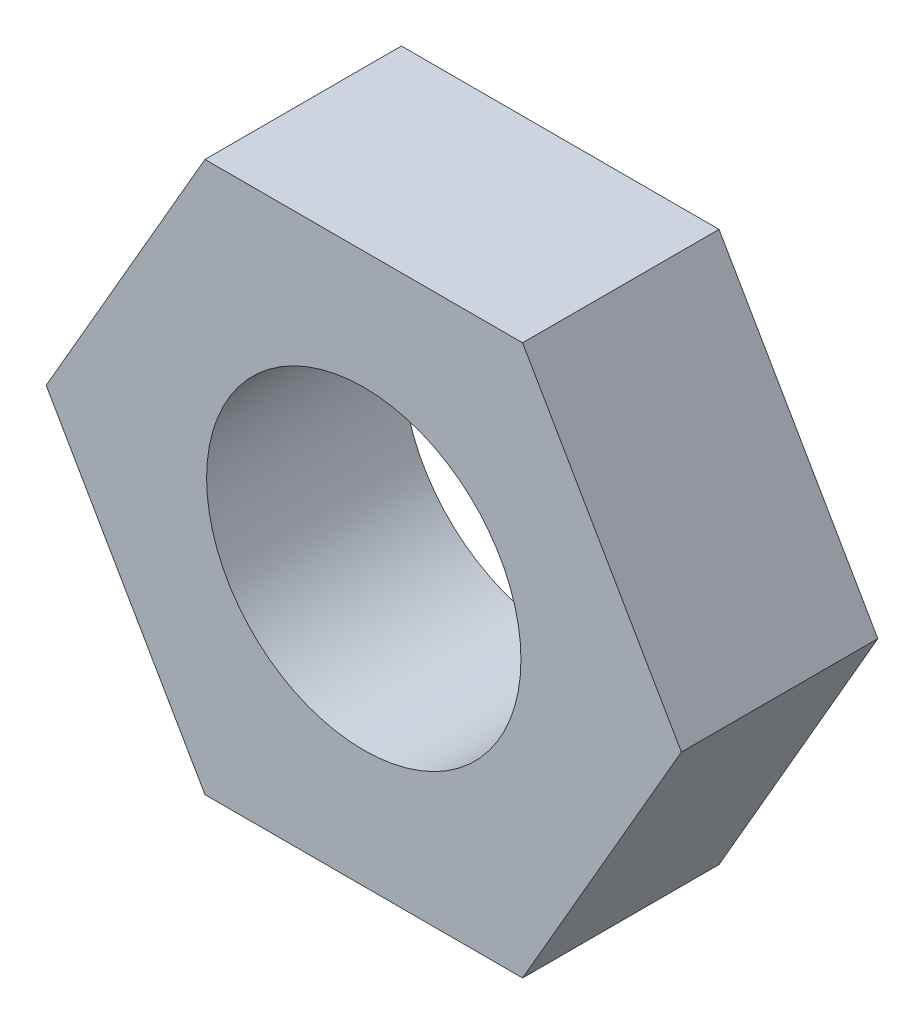
ISO-10303-21;
HEADER;
FILE_DESCRIPTION(('STEP AP214'),'2;1');
FILE_NAME('part.step','',(''),(''),'','','');
FILE_SCHEMA(('AUTOMOTIVE_DESIGN { 1 0 10303 214 1 1 1 1 }'));
ENDSEC;
DATA;
#1=APPLICATION_CONTEXT('core data for automotive mechanical design processes');
#2=APPLICATION_PROTOCOL_DEFINITION('international standard','automotive_design',2000,#1);
#3=PRODUCT_CONTEXT('',#1,'mechanical');
#4=PRODUCT('Part','Part','',(#3));
#5=PRODUCT_RELATED_PRODUCT_CATEGORY('part','',(#4));
#6=PRODUCT_DEFINITION_FORMATION('','',#4);
#7=PRODUCT_DEFINITION_CONTEXT('part definition',#1,'design');
#8=PRODUCT_DEFINITION('design','',#6,#7);
#9=PRODUCT_DEFINITION_SHAPE('','',#8);
#10=(LENGTH_UNIT() NAMED_UNIT(*) SI_UNIT(.MILLI.,.METRE.));
#11=(NAMED_UNIT(*) PLANE_ANGLE_UNIT() SI_UNIT($,.RADIAN.));
#12=(NAMED_UNIT(*) SI_UNIT($,.STERADIAN.) SOLID_ANGLE_UNIT());
#13=UNCERTAINTY_MEASURE_WITH_UNIT(LENGTH_MEASURE(1.E-05),#10,'distance_accuracy_value','');
#14=(GEOMETRIC_REPRESENTATION_CONTEXT(3) GLOBAL_UNCERTAINTY_ASSIGNED_CONTEXT((#13)) GLOBAL_UNIT_ASSIGNED_CONTEXT((#10,
#11,#12)) REPRESENTATION_CONTEXT('',''));
#15=CARTESIAN_POINT('',(0.,0.,0.));
#16=DIRECTION('',(0.,0.,1.));
#17=DIRECTION('',(1.,0.,0.));
#18=AXIS2_PLACEMENT_3D('',#15,#16,#17);
#19=CARTESIAN_POINT('',(0.,0.,2.5));
#20=DIRECTION('',(0.,0.,1.));
#21=DIRECTION('',(1.,0.,0.));
#22=AXIS2_PLACEMENT_3D('',#19,#20,#21);
#23=PLANE('',#22);
#24=DIRECTION('',(0.499999999999995,0.866025403784441,0.));
#25=VECTOR('',#24,1.);
#26=CARTESIAN_POINT('',(2.02072594216372,-3.49999999999996,2.5));
#27=LINE('',#26,#25);
#28=CARTESIAN_POINT('',(2.02072594216372,-3.49999999999996,2.5));
#29=VERTEX_POINT('',#28);
#30=CARTESIAN_POINT('',(4.04145188432737,0.,2.5));
#31=VERTEX_POINT('',#30);
#32=EDGE_CURVE('E148',#29,#31,#27,.T.);
#33=ORIENTED_EDGE('',*,*,#32,.T.);
#34=DIRECTION('',(-0.500000000000001,0.866025403784438,0.));
#35=VECTOR('',#34,1.);
#36=CARTESIAN_POINT('',(4.04145188432737,0.,2.5));
#37=LINE('',#36,#35);
#38=CARTESIAN_POINT('',(2.02072594216367,3.49999999999999,2.5));
#39=VERTEX_POINT('',#38);
#40=EDGE_CURVE('E96',#31,#39,#37,.T.);
#41=ORIENTED_EDGE('',*,*,#40,.T.);
#42=DIRECTION('',(-1.,0.,0.));
#43=VECTOR('',#42,1.);
#44=CARTESIAN_POINT('',(2.02072594216367,3.49999999999999,2.5));
#45=LINE('',#44,#43);
#46=CARTESIAN_POINT('',(-2.0207259421637,3.49999999999998,2.5));
#47=VERTEX_POINT('',#46);
#48=EDGE_CURVE('E109',#39,#47,#45,.T.);
#49=ORIENTED_EDGE('',*,*,#48,.T.);
#50=DIRECTION('',(-0.499999999999995,-0.866025403784441,0.));
#51=VECTOR('',#50,1.);
#52=CARTESIAN_POINT('',(-2.0207259421637,3.49999999999998,2.5));
#53=LINE('',#52,#51);
#54=CARTESIAN_POINT('',(-4.04145188432737,0.,2.5));
#55=VERTEX_POINT('',#54);
#56=EDGE_CURVE('E103',#47,#55,#53,.T.);
#57=ORIENTED_EDGE('',*,*,#56,.T.);
#58=DIRECTION('',(0.500000000000007,-0.866025403784434,0.));
#59=VECTOR('',#58,1.);
#60=CARTESIAN_POINT('',(-4.04145188432737,0.,2.5));
#61=LINE('',#60,#59);
#62=CARTESIAN_POINT('',(-2.02072594216365,-3.50000000000001,2.5));
#63=VERTEX_POINT('',#62);
#64=EDGE_CURVE('E107',#55,#63,#61,.T.);
#65=ORIENTED_EDGE('',*,*,#64,.T.);
#66=DIRECTION('',(1.,0.,0.));
#67=VECTOR('',#66,1.);
#68=CARTESIAN_POINT('',(-2.02072594216365,-3.50000000000001,2.5));
#69=LINE('',#68,#67);
#70=EDGE_CURVE('E59',#63,#29,#69,.T.);
#71=ORIENTED_EDGE('',*,*,#70,.T.);
#72=EDGE_LOOP('',(#33,#41,#49,#57,#65,#71));
#73=FACE_BOUND('',#72,.T.);
#74=CARTESIAN_POINT('',(0.,0.,2.5));
#75=DIRECTION('',(0.,0.,1.));
#76=DIRECTION('',(1.,0.,0.));
#77=AXIS2_PLACEMENT_3D('',#74,#75,#76);
#78=CIRCLE('',#77,2.);
#79=CARTESIAN_POINT('',(2.,0.,2.5));
#80=VERTEX_POINT('',#79);
#81=EDGE_CURVE('E136',#80,#80,#78,.T.);
#82=ORIENTED_EDGE('',*,*,#81,.F.);
#83=EDGE_LOOP('',(#82));
#84=FACE_BOUND('',#83,.T.);
#85=ADVANCED_FACE('F41',(#73,#84),#23,.T.);
#86=CARTESIAN_POINT('',(0.,0.,0.));
#87=DIRECTION('',(0.,0.,1.));
#88=DIRECTION('',(1.,0.,0.));
#89=AXIS2_PLACEMENT_3D('',#86,#87,#88);
#90=PLANE('',#89);
#91=DIRECTION('',(0.499999999999995,0.866025403784441,0.));
#92=VECTOR('',#91,1.);
#93=CARTESIAN_POINT('',(2.02072594216372,-3.49999999999996,0.));
#94=LINE('',#93,#92);
#95=CARTESIAN_POINT('',(2.02072594216372,-3.49999999999996,0.));
#96=VERTEX_POINT('',#95);
#97=CARTESIAN_POINT('',(4.04145188432737,0.,0.));
#98=VERTEX_POINT('',#97);
#99=EDGE_CURVE('E131',#96,#98,#94,.T.);
#100=ORIENTED_EDGE('',*,*,#99,.F.);
#101=DIRECTION('',(1.,0.,0.));
#102=VECTOR('',#101,1.);
#103=CARTESIAN_POINT('',(-2.02072594216365,-3.50000000000001,0.));
#104=LINE('',#103,#102);
#105=CARTESIAN_POINT('',(-2.02072594216365,-3.50000000000001,0.));
#106=VERTEX_POINT('',#105);
#107=EDGE_CURVE('E88',#106,#96,#104,.T.);
#108=ORIENTED_EDGE('',*,*,#107,.F.);
#109=DIRECTION('',(0.500000000000007,-0.866025403784434,0.));
#110=VECTOR('',#109,1.);
#111=CARTESIAN_POINT('',(-4.04145188432737,0.,0.));
#112=LINE('',#111,#110);
#113=CARTESIAN_POINT('',(-4.04145188432737,0.,0.));
#114=VERTEX_POINT('',#113);
#115=EDGE_CURVE('E82',#114,#106,#112,.T.);
#116=ORIENTED_EDGE('',*,*,#115,.F.);
#117=DIRECTION('',(-0.499999999999995,-0.866025403784441,0.));
#118=VECTOR('',#117,1.);
#119=CARTESIAN_POINT('',(-2.0207259421637,3.49999999999998,0.));
#120=LINE('',#119,#118);
#121=CARTESIAN_POINT('',(-2.0207259421637,3.49999999999998,0.));
#122=VERTEX_POINT('',#121);
#123=EDGE_CURVE('E118',#122,#114,#120,.T.);
#124=ORIENTED_EDGE('',*,*,#123,.F.);
#125=DIRECTION('',(-1.,0.,0.));
#126=VECTOR('',#125,1.);
#127=CARTESIAN_POINT('',(2.02072594216367,3.49999999999999,0.));
#128=LINE('',#127,#126);
#129=CARTESIAN_POINT('',(2.02072594216367,3.49999999999999,0.));
#130=VERTEX_POINT('',#129);
#131=EDGE_CURVE('E139',#130,#122,#128,.T.);
#132=ORIENTED_EDGE('',*,*,#131,.F.);
#133=DIRECTION('',(-0.500000000000001,0.866025403784438,0.));
#134=VECTOR('',#133,1.);
#135=CARTESIAN_POINT('',(4.04145188432737,0.,0.));
#136=LINE('',#135,#134);
#137=EDGE_CURVE('E135',#98,#130,#136,.T.);
#138=ORIENTED_EDGE('',*,*,#137,.F.);
#139=EDGE_LOOP('',(#100,#108,#116,#124,#132,#138));
#140=FACE_BOUND('',#139,.T.);
#141=CARTESIAN_POINT('',(0.,0.,0.));
#142=DIRECTION('',(0.,0.,1.));
#143=DIRECTION('',(1.,0.,0.));
#144=AXIS2_PLACEMENT_3D('',#141,#142,#143);
#145=CIRCLE('',#144,2.);
#146=CARTESIAN_POINT('',(2.,0.,0.));
#147=VERTEX_POINT('',#146);
#148=EDGE_CURVE('E245',#147,#147,#145,.T.);
#149=ORIENTED_EDGE('',*,*,#148,.T.);
#150=EDGE_LOOP('',(#149));
#151=FACE_BOUND('',#150,.T.);
#152=ADVANCED_FACE('F161',(#140,#151),#90,.F.);
#153=CARTESIAN_POINT('',(2.02072594216372,-3.49999999999996,2.5));
#154=DIRECTION('',(-0.866025403784442,0.499999999999995,0.));
#155=DIRECTION('',(-0.499999999999995,-0.866025403784442,0.));
#156=AXIS2_PLACEMENT_3D('',#153,#154,#155);
#157=PLANE('',#156);
#158=ORIENTED_EDGE('',*,*,#99,.T.);
#159=DIRECTION('',(0.,0.,-1.));
#160=VECTOR('',#159,1.);
#161=CARTESIAN_POINT('',(4.04145188432737,0.,2.5));
#162=LINE('',#161,#160);
#163=EDGE_CURVE('E11',#31,#98,#162,.T.);
#164=ORIENTED_EDGE('',*,*,#163,.F.);
#165=ORIENTED_EDGE('',*,*,#32,.F.);
#166=DIRECTION('',(0.,0.,-1.));
#167=VECTOR('',#166,1.);
#168=CARTESIAN_POINT('',(2.02072594216372,-3.49999999999996,2.5));
#169=LINE('',#168,#167);
#170=EDGE_CURVE('E127',#29,#96,#169,.T.);
#171=ORIENTED_EDGE('',*,*,#170,.T.);
#172=EDGE_LOOP('',(#158,#164,#165,#171));
#173=FACE_BOUND('',#172,.T.);
#174=ADVANCED_FACE('F43',(#173),#157,.F.);
#175=CARTESIAN_POINT('',(4.04145188432737,0.,2.5));
#176=DIRECTION('',(-0.866025403784438,-0.500000000000001,0.));
#177=DIRECTION('',(0.500000000000001,-0.866025403784438,0.));
#178=AXIS2_PLACEMENT_3D('',#175,#176,#177);
#179=PLANE('',#178);
#180=ORIENTED_EDGE('',*,*,#137,.T.);
#181=DIRECTION('',(0.,0.,-1.));
#182=VECTOR('',#181,1.);
#183=CARTESIAN_POINT('',(2.02072594216367,3.49999999999999,2.5));
#184=LINE('',#183,#182);
#185=EDGE_CURVE('E51',#39,#130,#184,.T.);
#186=ORIENTED_EDGE('',*,*,#185,.F.);
#187=ORIENTED_EDGE('',*,*,#40,.F.);
#188=ORIENTED_EDGE('',*,*,#163,.T.);
#189=EDGE_LOOP('',(#180,#186,#187,#188));
#190=FACE_BOUND('',#189,.T.);
#191=ADVANCED_FACE('F186',(#190),#179,.F.);
#192=CARTESIAN_POINT('',(2.02072594216367,3.49999999999999,2.5));
#193=DIRECTION('',(0.,-1.,0.));
#194=DIRECTION('',(1.,0.,0.));
#195=AXIS2_PLACEMENT_3D('',#192,#193,#194);
#196=PLANE('',#195);
#197=ORIENTED_EDGE('',*,*,#131,.T.);
#198=DIRECTION('',(0.,0.,-1.));
#199=VECTOR('',#198,1.);
#200=CARTESIAN_POINT('',(-2.0207259421637,3.49999999999998,2.5));
#201=LINE('',#200,#199);
#202=EDGE_CURVE('E120',#47,#122,#201,.T.);
#203=ORIENTED_EDGE('',*,*,#202,.F.);
#204=ORIENTED_EDGE('',*,*,#48,.F.);
#205=ORIENTED_EDGE('',*,*,#185,.T.);
#206=EDGE_LOOP('',(#197,#203,#204,#205));
#207=FACE_BOUND('',#206,.T.);
#208=ADVANCED_FACE('F158',(#207),#196,.F.);
#209=CARTESIAN_POINT('',(-2.0207259421637,3.49999999999998,2.5));
#210=DIRECTION('',(0.866025403784441,-0.499999999999995,0.));
#211=DIRECTION('',(0.499999999999995,0.866025403784441,0.));
#212=AXIS2_PLACEMENT_3D('',#209,#210,#211);
#213=PLANE('',#212);
#214=ORIENTED_EDGE('',*,*,#123,.T.);
#215=DIRECTION('',(0.,0.,-1.));
#216=VECTOR('',#215,1.);
#217=CARTESIAN_POINT('',(-4.04145188432737,0.,2.5));
#218=LINE('',#217,#216);
#219=EDGE_CURVE('E115',#55,#114,#218,.T.);
#220=ORIENTED_EDGE('',*,*,#219,.F.);
#221=ORIENTED_EDGE('',*,*,#56,.F.);
#222=ORIENTED_EDGE('',*,*,#202,.T.);
#223=EDGE_LOOP('',(#214,#220,#221,#222));
#224=FACE_BOUND('',#223,.T.);
#225=ADVANCED_FACE('F116',(#224),#213,.F.);
#226=CARTESIAN_POINT('',(-4.04145188432737,0.,2.5));
#227=DIRECTION('',(0.866025403784434,0.500000000000007,0.));
#228=DIRECTION('',(-0.500000000000007,0.866025403784435,0.));
#229=AXIS2_PLACEMENT_3D('',#226,#227,#228);
#230=PLANE('',#229);
#231=ORIENTED_EDGE('',*,*,#115,.T.);
#232=DIRECTION('',(0.,0.,-1.));
#233=VECTOR('',#232,1.);
#234=CARTESIAN_POINT('',(-2.02072594216365,-3.50000000000001,2.5));
#235=LINE('',#234,#233);
#236=EDGE_CURVE('E121',#63,#106,#235,.T.);
#237=ORIENTED_EDGE('',*,*,#236,.F.);
#238=ORIENTED_EDGE('',*,*,#64,.F.);
#239=ORIENTED_EDGE('',*,*,#219,.T.);
#240=EDGE_LOOP('',(#231,#237,#238,#239));
#241=FACE_BOUND('',#240,.T.);
#242=ADVANCED_FACE('F123',(#241),#230,.F.);
#243=CARTESIAN_POINT('',(-2.02072594216365,-3.50000000000001,2.5));
#244=DIRECTION('',(0.,1.,0.));
#245=DIRECTION('',(-1.,0.,0.));
#246=AXIS2_PLACEMENT_3D('',#243,#244,#245);
#247=PLANE('',#246);
#248=ORIENTED_EDGE('',*,*,#107,.T.);
#249=ORIENTED_EDGE('',*,*,#170,.F.);
#250=ORIENTED_EDGE('',*,*,#70,.F.);
#251=ORIENTED_EDGE('',*,*,#236,.T.);
#252=EDGE_LOOP('',(#248,#249,#250,#251));
#253=FACE_BOUND('',#252,.T.);
#254=ADVANCED_FACE('F166',(#253),#247,.F.);
#255=CARTESIAN_POINT('',(0.,0.,2.5));
#256=DIRECTION('',(0.,0.,-1.));
#257=DIRECTION('',(-1.,0.,0.));
#258=AXIS2_PLACEMENT_3D('',#255,#256,#257);
#259=CYLINDRICAL_SURFACE('',#258,2.);
#260=ORIENTED_EDGE('',*,*,#81,.T.);
#261=EDGE_LOOP('',(#260));
#262=FACE_BOUND('',#261,.T.);
#263=ORIENTED_EDGE('',*,*,#148,.F.);
#264=EDGE_LOOP('',(#263));
#265=FACE_BOUND('',#264,.T.);
#266=ADVANCED_FACE('F168',(#262,#265),#259,.F.);
#267=CLOSED_SHELL('',(#85,#152,#174,#191,#208,#225,#242,#254,#266));
#268=MANIFOLD_SOLID_BREP('B2',#267);
#269=ADVANCED_BREP_SHAPE_REPRESENTATION('',(#18,#268),#14);
#270=SHAPE_DEFINITION_REPRESENTATION(#9,#269);
ENDSEC;
END-ISO-10303-21;
